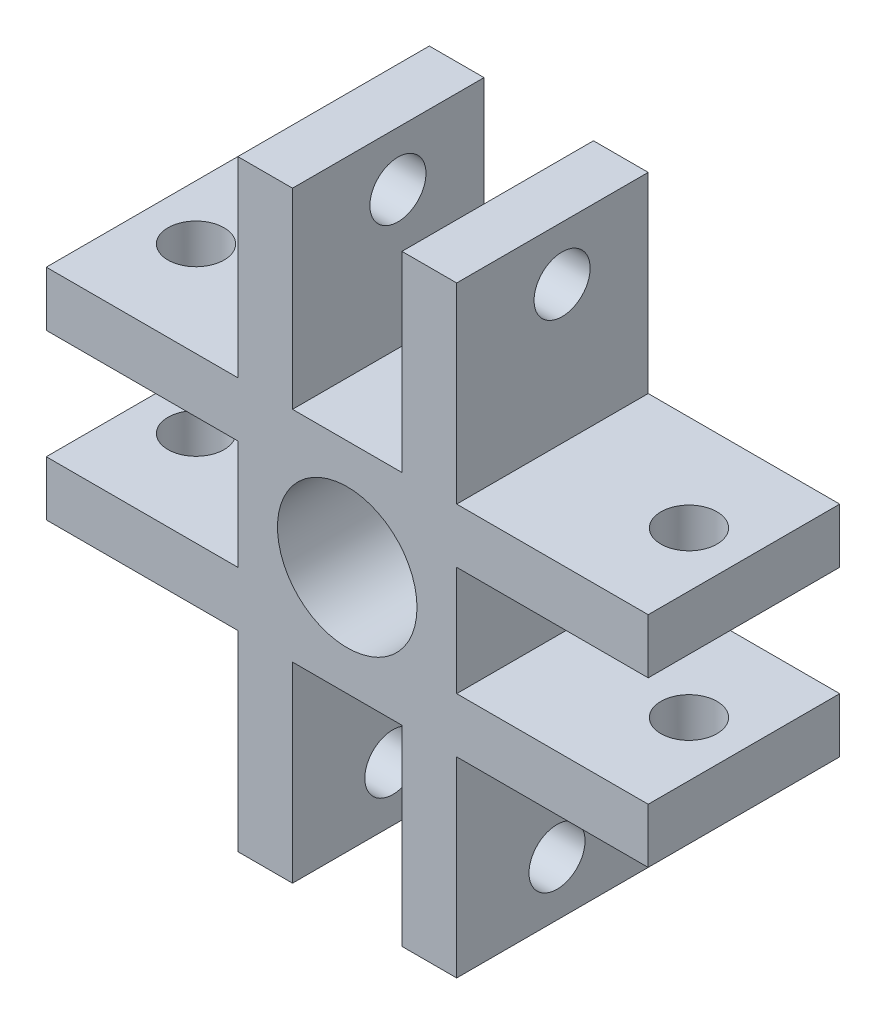
ISO-10303-21;
HEADER;
FILE_DESCRIPTION(('STEP AP214'),'2;1');
FILE_NAME('part.step','',(''),(''),'','','');
FILE_SCHEMA(('AUTOMOTIVE_DESIGN { 1 0 10303 214 1 1 1 1 }'));
ENDSEC;
DATA;
#1=APPLICATION_CONTEXT('core data for automotive mechanical design processes');
#2=APPLICATION_PROTOCOL_DEFINITION('international standard','automotive_design',2000,#1);
#3=PRODUCT_CONTEXT('',#1,'mechanical');
#4=PRODUCT('Part','Part','',(#3));
#5=PRODUCT_RELATED_PRODUCT_CATEGORY('part','',(#4));
#6=PRODUCT_DEFINITION_FORMATION('','',#4);
#7=PRODUCT_DEFINITION_CONTEXT('part definition',#1,'design');
#8=PRODUCT_DEFINITION('design','',#6,#7);
#9=PRODUCT_DEFINITION_SHAPE('','',#8);
#10=(LENGTH_UNIT() NAMED_UNIT(*) SI_UNIT(.MILLI.,.METRE.));
#11=(NAMED_UNIT(*) PLANE_ANGLE_UNIT() SI_UNIT($,.RADIAN.));
#12=(NAMED_UNIT(*) SI_UNIT($,.STERADIAN.) SOLID_ANGLE_UNIT());
#13=UNCERTAINTY_MEASURE_WITH_UNIT(LENGTH_MEASURE(1.E-05),#10,'distance_accuracy_value','');
#14=(GEOMETRIC_REPRESENTATION_CONTEXT(3) GLOBAL_UNCERTAINTY_ASSIGNED_CONTEXT((#13)) GLOBAL_UNIT_ASSIGNED_CONTEXT((#10,
#11,#12)) REPRESENTATION_CONTEXT('',''));
#15=CARTESIAN_POINT('',(0.,0.,0.));
#16=DIRECTION('',(0.,0.,1.));
#17=DIRECTION('',(1.,0.,0.));
#18=AXIS2_PLACEMENT_3D('',#15,#16,#17);
#19=CARTESIAN_POINT('',(11.,-11.,7.));
#20=DIRECTION('',(0.,0.,1.));
#21=DIRECTION('',(1.,0.,0.));
#22=AXIS2_PLACEMENT_3D('',#19,#20,#21);
#23=PLANE('',#22);
#24=CARTESIAN_POINT('',(0.,0.,7.));
#25=DIRECTION('',(0.,0.,1.));
#26=DIRECTION('',(1.,0.,0.));
#27=AXIS2_PLACEMENT_3D('',#24,#25,#26);
#28=CIRCLE('',#27,2.55);
#29=CARTESIAN_POINT('',(2.55,0.,7.));
#30=VERTEX_POINT('',#29);
#31=EDGE_CURVE('E259',#30,#30,#28,.T.);
#32=ORIENTED_EDGE('',*,*,#31,.F.);
#33=EDGE_LOOP('',(#32));
#34=FACE_BOUND('',#33,.T.);
#35=DIRECTION('',(-1.,0.,0.));
#36=VECTOR('',#35,1.);
#37=CARTESIAN_POINT('',(-0.933783745639004,-3.99999999999999,7.));
#38=LINE('',#37,#36);
#39=CARTESIAN_POINT('',(1.99999999999999,-4.00000000000001,7.));
#40=VERTEX_POINT('',#39);
#41=CARTESIAN_POINT('',(-2.00000000000001,-3.99999999999999,7.));
#42=VERTEX_POINT('',#41);
#43=EDGE_CURVE('E256',#40,#42,#38,.T.);
#44=ORIENTED_EDGE('',*,*,#43,.F.);
#45=DIRECTION('',(0.,-1.,0.));
#46=VECTOR('',#45,1.);
#47=CARTESIAN_POINT('',(1.99999999999991,-24.6504822813114,7.));
#48=LINE('',#47,#46);
#49=CARTESIAN_POINT('',(1.99999999999997,-11.,7.));
#50=VERTEX_POINT('',#49);
#51=EDGE_CURVE('E237',#40,#50,#48,.T.);
#52=ORIENTED_EDGE('',*,*,#51,.T.);
#53=DIRECTION('',(1.,0.,0.));
#54=VECTOR('',#53,1.);
#55=CARTESIAN_POINT('',(-11.,-11.,7.));
#56=LINE('',#55,#54);
#57=CARTESIAN_POINT('',(4.00000000000016,-11.,7.));
#58=VERTEX_POINT('',#57);
#59=EDGE_CURVE('E53',#50,#58,#56,.T.);
#60=ORIENTED_EDGE('',*,*,#59,.T.);
#61=DIRECTION('',(0.,-1.,0.));
#62=VECTOR('',#61,1.);
#63=CARTESIAN_POINT('',(4.00000000000016,-4.,7.));
#64=LINE('',#63,#62);
#65=CARTESIAN_POINT('',(4.00000000000016,-4.,7.));
#66=VERTEX_POINT('',#65);
#67=EDGE_CURVE('E349',#66,#58,#64,.T.);
#68=ORIENTED_EDGE('',*,*,#67,.F.);
#69=DIRECTION('',(-1.,0.,0.));
#70=VECTOR('',#69,1.);
#71=CARTESIAN_POINT('',(4.00000000000016,-4.,7.));
#72=LINE('',#71,#70);
#73=CARTESIAN_POINT('',(11.0000000000002,-4.,7.));
#74=VERTEX_POINT('',#73);
#75=EDGE_CURVE('E338',#74,#66,#72,.T.);
#76=ORIENTED_EDGE('',*,*,#75,.F.);
#77=DIRECTION('',(0.,1.,0.));
#78=VECTOR('',#77,1.);
#79=CARTESIAN_POINT('',(11.,11.,7.));
#80=LINE('',#79,#78);
#81=CARTESIAN_POINT('',(11.,-2.,7.));
#82=VERTEX_POINT('',#81);
#83=EDGE_CURVE('E420',#74,#82,#80,.T.);
#84=ORIENTED_EDGE('',*,*,#83,.T.);
#85=DIRECTION('',(1.,0.,0.));
#86=VECTOR('',#85,1.);
#87=CARTESIAN_POINT('',(-0.933783745639071,-2.,7.));
#88=LINE('',#87,#86);
#89=CARTESIAN_POINT('',(4.,-2.,7.));
#90=VERTEX_POINT('',#89);
#91=EDGE_CURVE('E69',#90,#82,#88,.T.);
#92=ORIENTED_EDGE('',*,*,#91,.F.);
#93=DIRECTION('',(0.,-1.,0.));
#94=VECTOR('',#93,1.);
#95=CARTESIAN_POINT('',(4.,-24.6504822813114,7.));
#96=LINE('',#95,#94);
#97=CARTESIAN_POINT('',(4.,2.,7.));
#98=VERTEX_POINT('',#97);
#99=EDGE_CURVE('E283',#98,#90,#96,.T.);
#100=ORIENTED_EDGE('',*,*,#99,.F.);
#101=DIRECTION('',(1.,0.,0.));
#102=VECTOR('',#101,1.);
#103=CARTESIAN_POINT('',(-0.933783745639071,2.,7.));
#104=LINE('',#103,#102);
#105=CARTESIAN_POINT('',(11.,2.,7.));
#106=VERTEX_POINT('',#105);
#107=EDGE_CURVE('E268',#98,#106,#104,.T.);
#108=ORIENTED_EDGE('',*,*,#107,.T.);
#109=CARTESIAN_POINT('',(11.,4.,7.));
#110=VERTEX_POINT('',#109);
#111=EDGE_CURVE('E424',#106,#110,#80,.T.);
#112=ORIENTED_EDGE('',*,*,#111,.T.);
#113=DIRECTION('',(1.,0.,0.));
#114=VECTOR('',#113,1.);
#115=CARTESIAN_POINT('',(4.,4.,7.));
#116=LINE('',#115,#114);
#117=CARTESIAN_POINT('',(4.,4.,7.));
#118=VERTEX_POINT('',#117);
#119=EDGE_CURVE('E386',#118,#110,#116,.T.);
#120=ORIENTED_EDGE('',*,*,#119,.F.);
#121=DIRECTION('',(0.,-1.,0.));
#122=VECTOR('',#121,1.);
#123=CARTESIAN_POINT('',(4.,11.,7.));
#124=LINE('',#123,#122);
#125=CARTESIAN_POINT('',(4.,11.,7.));
#126=VERTEX_POINT('',#125);
#127=EDGE_CURVE('E377',#126,#118,#124,.T.);
#128=ORIENTED_EDGE('',*,*,#127,.F.);
#129=DIRECTION('',(-1.,0.,0.));
#130=VECTOR('',#129,1.);
#131=CARTESIAN_POINT('',(-11.,11.,7.));
#132=LINE('',#131,#130);
#133=CARTESIAN_POINT('',(2.00000000000008,11.,7.));
#134=VERTEX_POINT('',#133);
#135=EDGE_CURVE('E425',#126,#134,#132,.T.);
#136=ORIENTED_EDGE('',*,*,#135,.T.);
#137=DIRECTION('',(0.,1.,0.));
#138=VECTOR('',#137,1.);
#139=CARTESIAN_POINT('',(1.99999999999974,-24.6504822813114,7.));
#140=LINE('',#139,#138);
#141=CARTESIAN_POINT('',(2.00000000000004,3.99999999999998,7.));
#142=VERTEX_POINT('',#141);
#143=EDGE_CURVE('E298',#142,#134,#140,.T.);
#144=ORIENTED_EDGE('',*,*,#143,.F.);
#145=DIRECTION('',(1.,0.,0.));
#146=VECTOR('',#145,1.);
#147=CARTESIAN_POINT('',(-0.933783745638779,4.00000000000001,7.));
#148=LINE('',#147,#146);
#149=CARTESIAN_POINT('',(-1.99999999999996,4.00000000000002,7.));
#150=VERTEX_POINT('',#149);
#151=EDGE_CURVE('E307',#150,#142,#148,.T.);
#152=ORIENTED_EDGE('',*,*,#151,.F.);
#153=DIRECTION('',(0.,1.,0.));
#154=VECTOR('',#153,1.);
#155=CARTESIAN_POINT('',(-2.00000000000026,-24.6504822813114,7.));
#156=LINE('',#155,#154);
#157=CARTESIAN_POINT('',(-1.99999999999992,11.,7.));
#158=VERTEX_POINT('',#157);
#159=EDGE_CURVE('E289',#150,#158,#156,.T.);
#160=ORIENTED_EDGE('',*,*,#159,.T.);
#161=CARTESIAN_POINT('',(-4.,11.,7.));
#162=VERTEX_POINT('',#161);
#163=EDGE_CURVE('E423',#158,#162,#132,.T.);
#164=ORIENTED_EDGE('',*,*,#163,.T.);
#165=DIRECTION('',(0.,1.,0.));
#166=VECTOR('',#165,1.);
#167=CARTESIAN_POINT('',(-4.,11.,7.));
#168=LINE('',#167,#166);
#169=CARTESIAN_POINT('',(-4.,4.,7.));
#170=VERTEX_POINT('',#169);
#171=EDGE_CURVE('E405',#170,#162,#168,.T.);
#172=ORIENTED_EDGE('',*,*,#171,.F.);
#173=DIRECTION('',(1.,0.,0.));
#174=VECTOR('',#173,1.);
#175=CARTESIAN_POINT('',(-11.,4.,7.));
#176=LINE('',#175,#174);
#177=CARTESIAN_POINT('',(-11.,4.,7.));
#178=VERTEX_POINT('',#177);
#179=EDGE_CURVE('E397',#178,#170,#176,.T.);
#180=ORIENTED_EDGE('',*,*,#179,.F.);
#181=DIRECTION('',(0.,-1.,0.));
#182=VECTOR('',#181,1.);
#183=CARTESIAN_POINT('',(-11.,11.,7.));
#184=LINE('',#183,#182);
#185=CARTESIAN_POINT('',(-11.,2.00000000000005,7.));
#186=VERTEX_POINT('',#185);
#187=EDGE_CURVE('E429',#178,#186,#184,.T.);
#188=ORIENTED_EDGE('',*,*,#187,.T.);
#189=DIRECTION('',(-1.,0.,0.));
#190=VECTOR('',#189,1.);
#191=CARTESIAN_POINT('',(-0.933783745638885,2.00000000000001,7.));
#192=LINE('',#191,#190);
#193=CARTESIAN_POINT('',(-3.99999999999999,2.00000000000003,7.));
#194=VERTEX_POINT('',#193);
#195=EDGE_CURVE('E323',#194,#186,#192,.T.);
#196=ORIENTED_EDGE('',*,*,#195,.F.);
#197=DIRECTION('',(0.,1.,0.));
#198=VECTOR('',#197,1.);
#199=CARTESIAN_POINT('',(-4.00000000000017,-24.6504822813114,7.));
#200=LINE('',#199,#198);
#201=CARTESIAN_POINT('',(-4.00000000000001,-1.99999999999997,7.));
#202=VERTEX_POINT('',#201);
#203=EDGE_CURVE('E332',#202,#194,#200,.T.);
#204=ORIENTED_EDGE('',*,*,#203,.F.);
#205=DIRECTION('',(-1.,0.,0.));
#206=VECTOR('',#205,1.);
#207=CARTESIAN_POINT('',(-0.933783745638913,-1.99999999999999,7.));
#208=LINE('',#207,#206);
#209=CARTESIAN_POINT('',(-11.,-1.99999999999995,7.));
#210=VERTEX_POINT('',#209);
#211=EDGE_CURVE('E313',#202,#210,#208,.T.);
#212=ORIENTED_EDGE('',*,*,#211,.T.);
#213=CARTESIAN_POINT('',(-10.9999999999998,-4.,7.));
#214=VERTEX_POINT('',#213);
#215=EDGE_CURVE('E428',#210,#214,#184,.T.);
#216=ORIENTED_EDGE('',*,*,#215,.T.);
#217=DIRECTION('',(-1.,0.,0.));
#218=VECTOR('',#217,1.);
#219=CARTESIAN_POINT('',(-10.9999999999998,-4.,7.));
#220=LINE('',#219,#218);
#221=CARTESIAN_POINT('',(-3.99999999999984,-4.,7.));
#222=VERTEX_POINT('',#221);
#223=EDGE_CURVE('E358',#222,#214,#220,.T.);
#224=ORIENTED_EDGE('',*,*,#223,.F.);
#225=DIRECTION('',(0.,1.,0.));
#226=VECTOR('',#225,1.);
#227=CARTESIAN_POINT('',(-3.99999999999984,-4.,7.));
#228=LINE('',#227,#226);
#229=CARTESIAN_POINT('',(-3.99999999999984,-11.,7.));
#230=VERTEX_POINT('',#229);
#231=EDGE_CURVE('E367',#230,#222,#228,.T.);
#232=ORIENTED_EDGE('',*,*,#231,.F.);
#233=CARTESIAN_POINT('',(-2.00000000000003,-11.,7.));
#234=VERTEX_POINT('',#233);
#235=EDGE_CURVE('E13',#230,#234,#56,.T.);
#236=ORIENTED_EDGE('',*,*,#235,.T.);
#237=DIRECTION('',(0.,-1.,0.));
#238=VECTOR('',#237,1.);
#239=CARTESIAN_POINT('',(-2.00000000000009,-24.6504822813114,7.));
#240=LINE('',#239,#238);
#241=EDGE_CURVE('E61',#42,#234,#240,.T.);
#242=ORIENTED_EDGE('',*,*,#241,.F.);
#243=EDGE_LOOP('',(#44,#52,#60,#68,#76,#84,#92,#100,#108,#112,#120,#128,#136,#144,#152,#160,
#164,#172,#180,#188,#196,#204,#212,#216,#224,#232,#236,#242));
#244=FACE_BOUND('',#243,.T.);
#245=ADVANCED_FACE('F44',(#34,#244),#23,.T.);
#246=CARTESIAN_POINT('',(11.,-11.,0.));
#247=DIRECTION('',(0.,0.,1.));
#248=DIRECTION('',(1.,0.,0.));
#249=AXIS2_PLACEMENT_3D('',#246,#247,#248);
#250=PLANE('',#249);
#251=CARTESIAN_POINT('',(0.,0.,0.));
#252=DIRECTION('',(0.,0.,1.));
#253=DIRECTION('',(1.,0.,0.));
#254=AXIS2_PLACEMENT_3D('',#251,#252,#253);
#255=CIRCLE('',#254,2.55);
#256=CARTESIAN_POINT('',(2.55,0.,0.));
#257=VERTEX_POINT('',#256);
#258=EDGE_CURVE('E264',#257,#257,#255,.T.);
#259=ORIENTED_EDGE('',*,*,#258,.T.);
#260=EDGE_LOOP('',(#259));
#261=FACE_BOUND('',#260,.T.);
#262=DIRECTION('',(0.,-1.,0.));
#263=VECTOR('',#262,1.);
#264=CARTESIAN_POINT('',(1.99999999999991,-24.6504822813114,0.));
#265=LINE('',#264,#263);
#266=CARTESIAN_POINT('',(1.99999999999999,-4.00000000000001,0.));
#267=VERTEX_POINT('',#266);
#268=CARTESIAN_POINT('',(1.99999999999997,-11.,0.));
#269=VERTEX_POINT('',#268);
#270=EDGE_CURVE('E234',#267,#269,#265,.T.);
#271=ORIENTED_EDGE('',*,*,#270,.F.);
#272=DIRECTION('',(-1.,0.,0.));
#273=VECTOR('',#272,1.);
#274=CARTESIAN_POINT('',(-0.933783745639004,-3.99999999999999,0.));
#275=LINE('',#274,#273);
#276=CARTESIAN_POINT('',(-2.00000000000001,-3.99999999999999,0.));
#277=VERTEX_POINT('',#276);
#278=EDGE_CURVE('E245',#267,#277,#275,.T.);
#279=ORIENTED_EDGE('',*,*,#278,.T.);
#280=DIRECTION('',(0.,-1.,0.));
#281=VECTOR('',#280,1.);
#282=CARTESIAN_POINT('',(-2.00000000000009,-24.6504822813114,0.));
#283=LINE('',#282,#281);
#284=CARTESIAN_POINT('',(-2.00000000000003,-11.,0.));
#285=VERTEX_POINT('',#284);
#286=EDGE_CURVE('E242',#277,#285,#283,.T.);
#287=ORIENTED_EDGE('',*,*,#286,.T.);
#288=DIRECTION('',(1.,0.,0.));
#289=VECTOR('',#288,1.);
#290=CARTESIAN_POINT('',(-11.,-11.,0.));
#291=LINE('',#290,#289);
#292=CARTESIAN_POINT('',(-3.99999999999984,-11.,0.));
#293=VERTEX_POINT('',#292);
#294=EDGE_CURVE('E443',#293,#285,#291,.T.);
#295=ORIENTED_EDGE('',*,*,#294,.F.);
#296=DIRECTION('',(0.,1.,0.));
#297=VECTOR('',#296,1.);
#298=CARTESIAN_POINT('',(-3.99999999999984,-4.,0.));
#299=LINE('',#298,#297);
#300=CARTESIAN_POINT('',(-3.99999999999984,-4.,0.));
#301=VERTEX_POINT('',#300);
#302=EDGE_CURVE('E366',#293,#301,#299,.T.);
#303=ORIENTED_EDGE('',*,*,#302,.T.);
#304=DIRECTION('',(-1.,0.,0.));
#305=VECTOR('',#304,1.);
#306=CARTESIAN_POINT('',(-10.9999999999998,-4.,0.));
#307=LINE('',#306,#305);
#308=CARTESIAN_POINT('',(-10.9999999999998,-4.,0.));
#309=VERTEX_POINT('',#308);
#310=EDGE_CURVE('E363',#301,#309,#307,.T.);
#311=ORIENTED_EDGE('',*,*,#310,.T.);
#312=DIRECTION('',(0.,-1.,0.));
#313=VECTOR('',#312,1.);
#314=CARTESIAN_POINT('',(-11.,11.,0.));
#315=LINE('',#314,#313);
#316=CARTESIAN_POINT('',(-11.,-1.99999999999995,0.));
#317=VERTEX_POINT('',#316);
#318=EDGE_CURVE('E439',#317,#309,#315,.T.);
#319=ORIENTED_EDGE('',*,*,#318,.F.);
#320=DIRECTION('',(-1.,0.,0.));
#321=VECTOR('',#320,1.);
#322=CARTESIAN_POINT('',(-0.933783745638913,-1.99999999999999,0.));
#323=LINE('',#322,#321);
#324=CARTESIAN_POINT('',(-4.00000000000001,-1.99999999999997,0.));
#325=VERTEX_POINT('',#324);
#326=EDGE_CURVE('E320',#325,#317,#323,.T.);
#327=ORIENTED_EDGE('',*,*,#326,.F.);
#328=DIRECTION('',(0.,1.,0.));
#329=VECTOR('',#328,1.);
#330=CARTESIAN_POINT('',(-4.00000000000017,-24.6504822813114,0.));
#331=LINE('',#330,#329);
#332=CARTESIAN_POINT('',(-3.99999999999999,2.00000000000003,0.));
#333=VERTEX_POINT('',#332);
#334=EDGE_CURVE('E322',#325,#333,#331,.T.);
#335=ORIENTED_EDGE('',*,*,#334,.T.);
#336=DIRECTION('',(-1.,0.,0.));
#337=VECTOR('',#336,1.);
#338=CARTESIAN_POINT('',(-0.933783745638885,2.00000000000001,0.));
#339=LINE('',#338,#337);
#340=CARTESIAN_POINT('',(-11.,2.00000000000005,0.));
#341=VERTEX_POINT('',#340);
#342=EDGE_CURVE('E326',#333,#341,#339,.T.);
#343=ORIENTED_EDGE('',*,*,#342,.T.);
#344=CARTESIAN_POINT('',(-11.,4.,0.));
#345=VERTEX_POINT('',#344);
#346=EDGE_CURVE('E440',#345,#341,#315,.T.);
#347=ORIENTED_EDGE('',*,*,#346,.F.);
#348=DIRECTION('',(1.,0.,0.));
#349=VECTOR('',#348,1.);
#350=CARTESIAN_POINT('',(-11.,4.,0.));
#351=LINE('',#350,#349);
#352=CARTESIAN_POINT('',(-4.,4.,0.));
#353=VERTEX_POINT('',#352);
#354=EDGE_CURVE('E401',#345,#353,#351,.T.);
#355=ORIENTED_EDGE('',*,*,#354,.T.);
#356=DIRECTION('',(0.,1.,0.));
#357=VECTOR('',#356,1.);
#358=CARTESIAN_POINT('',(-4.,11.,0.));
#359=LINE('',#358,#357);
#360=CARTESIAN_POINT('',(-4.,11.,0.));
#361=VERTEX_POINT('',#360);
#362=EDGE_CURVE('E404',#353,#361,#359,.T.);
#363=ORIENTED_EDGE('',*,*,#362,.T.);
#364=DIRECTION('',(-1.,0.,0.));
#365=VECTOR('',#364,1.);
#366=CARTESIAN_POINT('',(-11.,11.,0.));
#367=LINE('',#366,#365);
#368=CARTESIAN_POINT('',(-1.99999999999992,11.,0.));
#369=VERTEX_POINT('',#368);
#370=EDGE_CURVE('E435',#369,#361,#367,.T.);
#371=ORIENTED_EDGE('',*,*,#370,.F.);
#372=DIRECTION('',(0.,1.,0.));
#373=VECTOR('',#372,1.);
#374=CARTESIAN_POINT('',(-2.00000000000026,-24.6504822813114,0.));
#375=LINE('',#374,#373);
#376=CARTESIAN_POINT('',(-1.99999999999996,4.00000000000002,0.));
#377=VERTEX_POINT('',#376);
#378=EDGE_CURVE('E295',#377,#369,#375,.T.);
#379=ORIENTED_EDGE('',*,*,#378,.F.);
#380=DIRECTION('',(1.,0.,0.));
#381=VECTOR('',#380,1.);
#382=CARTESIAN_POINT('',(-0.933783745638779,4.00000000000001,0.));
#383=LINE('',#382,#381);
#384=CARTESIAN_POINT('',(2.00000000000004,3.99999999999998,0.));
#385=VERTEX_POINT('',#384);
#386=EDGE_CURVE('E297',#377,#385,#383,.T.);
#387=ORIENTED_EDGE('',*,*,#386,.T.);
#388=DIRECTION('',(0.,1.,0.));
#389=VECTOR('',#388,1.);
#390=CARTESIAN_POINT('',(1.99999999999974,-24.6504822813114,0.));
#391=LINE('',#390,#389);
#392=CARTESIAN_POINT('',(2.00000000000008,11.,0.));
#393=VERTEX_POINT('',#392);
#394=EDGE_CURVE('E301',#385,#393,#391,.T.);
#395=ORIENTED_EDGE('',*,*,#394,.T.);
#396=CARTESIAN_POINT('',(4.,11.,0.));
#397=VERTEX_POINT('',#396);
#398=EDGE_CURVE('E436',#397,#393,#367,.T.);
#399=ORIENTED_EDGE('',*,*,#398,.F.);
#400=DIRECTION('',(0.,-1.,0.));
#401=VECTOR('',#400,1.);
#402=CARTESIAN_POINT('',(4.,11.,0.));
#403=LINE('',#402,#401);
#404=CARTESIAN_POINT('',(4.,4.,0.));
#405=VERTEX_POINT('',#404);
#406=EDGE_CURVE('E382',#397,#405,#403,.T.);
#407=ORIENTED_EDGE('',*,*,#406,.T.);
#408=DIRECTION('',(1.,0.,0.));
#409=VECTOR('',#408,1.);
#410=CARTESIAN_POINT('',(4.,4.,0.));
#411=LINE('',#410,#409);
#412=CARTESIAN_POINT('',(11.,4.,0.));
#413=VERTEX_POINT('',#412);
#414=EDGE_CURVE('E385',#405,#413,#411,.T.);
#415=ORIENTED_EDGE('',*,*,#414,.T.);
#416=DIRECTION('',(0.,1.,0.));
#417=VECTOR('',#416,1.);
#418=CARTESIAN_POINT('',(11.,11.,0.));
#419=LINE('',#418,#417);
#420=CARTESIAN_POINT('',(11.,2.,0.));
#421=VERTEX_POINT('',#420);
#422=EDGE_CURVE('E416',#421,#413,#419,.T.);
#423=ORIENTED_EDGE('',*,*,#422,.F.);
#424=DIRECTION('',(1.,0.,0.));
#425=VECTOR('',#424,1.);
#426=CARTESIAN_POINT('',(-0.933783745639071,2.,0.));
#427=LINE('',#426,#425);
#428=CARTESIAN_POINT('',(4.,2.,0.));
#429=VERTEX_POINT('',#428);
#430=EDGE_CURVE('E272',#429,#421,#427,.T.);
#431=ORIENTED_EDGE('',*,*,#430,.F.);
#432=DIRECTION('',(0.,-1.,0.));
#433=VECTOR('',#432,1.);
#434=CARTESIAN_POINT('',(4.,-24.6504822813114,0.));
#435=LINE('',#434,#433);
#436=CARTESIAN_POINT('',(4.,-2.,0.));
#437=VERTEX_POINT('',#436);
#438=EDGE_CURVE('E274',#429,#437,#435,.T.);
#439=ORIENTED_EDGE('',*,*,#438,.T.);
#440=DIRECTION('',(1.,0.,0.));
#441=VECTOR('',#440,1.);
#442=CARTESIAN_POINT('',(-0.933783745639071,-2.,0.));
#443=LINE('',#442,#441);
#444=CARTESIAN_POINT('',(11.,-2.,0.));
#445=VERTEX_POINT('',#444);
#446=EDGE_CURVE('E277',#437,#445,#443,.T.);
#447=ORIENTED_EDGE('',*,*,#446,.T.);
#448=CARTESIAN_POINT('',(11.0000000000002,-4.,0.));
#449=VERTEX_POINT('',#448);
#450=EDGE_CURVE('E432',#449,#445,#419,.T.);
#451=ORIENTED_EDGE('',*,*,#450,.F.);
#452=DIRECTION('',(-1.,0.,0.));
#453=VECTOR('',#452,1.);
#454=CARTESIAN_POINT('',(4.00000000000016,-4.,0.));
#455=LINE('',#454,#453);
#456=CARTESIAN_POINT('',(4.00000000000016,-4.,0.));
#457=VERTEX_POINT('',#456);
#458=EDGE_CURVE('E345',#449,#457,#455,.T.);
#459=ORIENTED_EDGE('',*,*,#458,.T.);
#460=DIRECTION('',(0.,-1.,0.));
#461=VECTOR('',#460,1.);
#462=CARTESIAN_POINT('',(4.00000000000016,-4.,0.));
#463=LINE('',#462,#461);
#464=CARTESIAN_POINT('',(4.00000000000016,-11.,0.));
#465=VERTEX_POINT('',#464);
#466=EDGE_CURVE('E348',#457,#465,#463,.T.);
#467=ORIENTED_EDGE('',*,*,#466,.T.);
#468=EDGE_CURVE('E254',#269,#465,#291,.T.);
#469=ORIENTED_EDGE('',*,*,#468,.F.);
#470=EDGE_LOOP('',(#271,#279,#287,#295,#303,#311,#319,#327,#335,#343,#347,#355,#363,#371,#379,
#387,#395,#399,#407,#415,#423,#431,#439,#447,#451,#459,#467,#469));
#471=FACE_BOUND('',#470,.T.);
#472=ADVANCED_FACE('F252',(#261,#471),#250,.F.);
#473=CARTESIAN_POINT('',(-11.,-11.,7.));
#474=DIRECTION('',(0.,1.,0.));
#475=DIRECTION('',(0.,0.,1.));
#476=AXIS2_PLACEMENT_3D('',#473,#474,#475);
#477=PLANE('',#476);
#478=DIRECTION('',(0.,0.,1.));
#479=VECTOR('',#478,1.);
#480=CARTESIAN_POINT('',(1.99999999999997,-11.,0.));
#481=LINE('',#480,#479);
#482=EDGE_CURVE('E266',#269,#50,#481,.T.);
#483=ORIENTED_EDGE('',*,*,#482,.F.);
#484=ORIENTED_EDGE('',*,*,#468,.T.);
#485=DIRECTION('',(0.,0.,1.));
#486=VECTOR('',#485,1.);
#487=CARTESIAN_POINT('',(4.00000000000016,-11.,0.));
#488=LINE('',#487,#486);
#489=EDGE_CURVE('E359',#465,#58,#488,.T.);
#490=ORIENTED_EDGE('',*,*,#489,.T.);
#491=ORIENTED_EDGE('',*,*,#59,.F.);
#492=EDGE_LOOP('',(#483,#484,#490,#491));
#493=FACE_BOUND('',#492,.T.);
#494=ADVANCED_FACE('F604',(#493),#477,.F.);
#495=CARTESIAN_POINT('',(11.,11.,7.));
#496=DIRECTION('',(-1.,0.,0.));
#497=DIRECTION('',(0.,-1.,0.));
#498=AXIS2_PLACEMENT_3D('',#495,#496,#497);
#499=PLANE('',#498);
#500=DIRECTION('',(0.,0.,1.));
#501=VECTOR('',#500,1.);
#502=CARTESIAN_POINT('',(11.,2.,0.));
#503=LINE('',#502,#501);
#504=EDGE_CURVE('E287',#421,#106,#503,.T.);
#505=ORIENTED_EDGE('',*,*,#504,.F.);
#506=ORIENTED_EDGE('',*,*,#422,.T.);
#507=DIRECTION('',(0.,0.,1.));
#508=VECTOR('',#507,1.);
#509=CARTESIAN_POINT('',(11.,4.,0.));
#510=LINE('',#509,#508);
#511=EDGE_CURVE('E394',#413,#110,#510,.T.);
#512=ORIENTED_EDGE('',*,*,#511,.T.);
#513=ORIENTED_EDGE('',*,*,#111,.F.);
#514=EDGE_LOOP('',(#505,#506,#512,#513));
#515=FACE_BOUND('',#514,.T.);
#516=ADVANCED_FACE('F579',(#515),#499,.F.);
#517=CARTESIAN_POINT('',(-11.,11.,7.));
#518=DIRECTION('',(0.,-1.,0.));
#519=DIRECTION('',(0.,0.,-1.));
#520=AXIS2_PLACEMENT_3D('',#517,#518,#519);
#521=PLANE('',#520);
#522=DIRECTION('',(0.,0.,1.));
#523=VECTOR('',#522,1.);
#524=CARTESIAN_POINT('',(-1.99999999999992,11.,0.));
#525=LINE('',#524,#523);
#526=EDGE_CURVE('E311',#369,#158,#525,.T.);
#527=ORIENTED_EDGE('',*,*,#526,.F.);
#528=ORIENTED_EDGE('',*,*,#370,.T.);
#529=DIRECTION('',(0.,0.,1.));
#530=VECTOR('',#529,1.);
#531=CARTESIAN_POINT('',(-4.,11.,0.));
#532=LINE('',#531,#530);
#533=EDGE_CURVE('E413',#361,#162,#532,.T.);
#534=ORIENTED_EDGE('',*,*,#533,.T.);
#535=ORIENTED_EDGE('',*,*,#163,.F.);
#536=EDGE_LOOP('',(#527,#528,#534,#535));
#537=FACE_BOUND('',#536,.T.);
#538=ADVANCED_FACE('F549',(#537),#521,.F.);
#539=CARTESIAN_POINT('',(-11.,11.,7.));
#540=DIRECTION('',(1.,0.,0.));
#541=DIRECTION('',(0.,1.,0.));
#542=AXIS2_PLACEMENT_3D('',#539,#540,#541);
#543=PLANE('',#542);
#544=DIRECTION('',(0.,0.,1.));
#545=VECTOR('',#544,1.);
#546=CARTESIAN_POINT('',(-11.,-1.99999999999995,0.));
#547=LINE('',#546,#545);
#548=EDGE_CURVE('E336',#317,#210,#547,.T.);
#549=ORIENTED_EDGE('',*,*,#548,.F.);
#550=ORIENTED_EDGE('',*,*,#318,.T.);
#551=DIRECTION('',(0.,0.,1.));
#552=VECTOR('',#551,1.);
#553=CARTESIAN_POINT('',(-10.9999999999998,-4.,0.));
#554=LINE('',#553,#552);
#555=EDGE_CURVE('E370',#309,#214,#554,.T.);
#556=ORIENTED_EDGE('',*,*,#555,.T.);
#557=ORIENTED_EDGE('',*,*,#215,.F.);
#558=EDGE_LOOP('',(#549,#550,#556,#557));
#559=FACE_BOUND('',#558,.T.);
#560=ADVANCED_FACE('F520',(#559),#543,.F.);
#561=ORIENTED_EDGE('',*,*,#450,.T.);
#562=DIRECTION('',(0.,0.,1.));
#563=VECTOR('',#562,1.);
#564=CARTESIAN_POINT('',(11.,-2.,0.));
#565=LINE('',#564,#563);
#566=EDGE_CURVE('E290',#445,#82,#565,.T.);
#567=ORIENTED_EDGE('',*,*,#566,.T.);
#568=ORIENTED_EDGE('',*,*,#83,.F.);
#569=DIRECTION('',(0.,0.,1.));
#570=VECTOR('',#569,1.);
#571=CARTESIAN_POINT('',(11.0000000000002,-4.,0.));
#572=LINE('',#571,#570);
#573=EDGE_CURVE('E356',#449,#74,#572,.T.);
#574=ORIENTED_EDGE('',*,*,#573,.F.);
#575=EDGE_LOOP('',(#561,#567,#568,#574));
#576=FACE_BOUND('',#575,.T.);
#577=ADVANCED_FACE('F46',(#576),#499,.F.);
#578=ORIENTED_EDGE('',*,*,#398,.T.);
#579=DIRECTION('',(0.,0.,1.));
#580=VECTOR('',#579,1.);
#581=CARTESIAN_POINT('',(2.00000000000008,11.,0.));
#582=LINE('',#581,#580);
#583=EDGE_CURVE('E314',#393,#134,#582,.T.);
#584=ORIENTED_EDGE('',*,*,#583,.T.);
#585=ORIENTED_EDGE('',*,*,#135,.F.);
#586=DIRECTION('',(0.,0.,1.));
#587=VECTOR('',#586,1.);
#588=CARTESIAN_POINT('',(4.,11.,0.));
#589=LINE('',#588,#587);
#590=EDGE_CURVE('E389',#397,#126,#589,.T.);
#591=ORIENTED_EDGE('',*,*,#590,.F.);
#592=EDGE_LOOP('',(#578,#584,#585,#591));
#593=FACE_BOUND('',#592,.T.);
#594=ADVANCED_FACE('F566',(#593),#521,.F.);
#595=ORIENTED_EDGE('',*,*,#346,.T.);
#596=DIRECTION('',(0.,0.,1.));
#597=VECTOR('',#596,1.);
#598=CARTESIAN_POINT('',(-11.,2.00000000000005,0.));
#599=LINE('',#598,#597);
#600=EDGE_CURVE('E339',#341,#186,#599,.T.);
#601=ORIENTED_EDGE('',*,*,#600,.T.);
#602=ORIENTED_EDGE('',*,*,#187,.F.);
#603=DIRECTION('',(0.,0.,1.));
#604=VECTOR('',#603,1.);
#605=CARTESIAN_POINT('',(-11.,4.,0.));
#606=LINE('',#605,#604);
#607=EDGE_CURVE('E408',#345,#178,#606,.T.);
#608=ORIENTED_EDGE('',*,*,#607,.F.);
#609=EDGE_LOOP('',(#595,#601,#602,#608));
#610=FACE_BOUND('',#609,.T.);
#611=ADVANCED_FACE('F536',(#610),#543,.F.);
#612=ORIENTED_EDGE('',*,*,#294,.T.);
#613=DIRECTION('',(0.,0.,1.));
#614=VECTOR('',#613,1.);
#615=CARTESIAN_POINT('',(-2.00000000000003,-11.,0.));
#616=LINE('',#615,#614);
#617=EDGE_CURVE('E269',#285,#234,#616,.T.);
#618=ORIENTED_EDGE('',*,*,#617,.T.);
#619=ORIENTED_EDGE('',*,*,#235,.F.);
#620=DIRECTION('',(0.,0.,1.));
#621=VECTOR('',#620,1.);
#622=CARTESIAN_POINT('',(-3.99999999999984,-11.,0.));
#623=LINE('',#622,#621);
#624=EDGE_CURVE('E378',#293,#230,#623,.T.);
#625=ORIENTED_EDGE('',*,*,#624,.F.);
#626=EDGE_LOOP('',(#612,#618,#619,#625));
#627=FACE_BOUND('',#626,.T.);
#628=ADVANCED_FACE('F507',(#627),#477,.F.);
#629=CARTESIAN_POINT('',(-4.,11.,0.));
#630=DIRECTION('',(1.,0.,0.));
#631=DIRECTION('',(0.,0.,-1.));
#632=AXIS2_PLACEMENT_3D('',#629,#630,#631);
#633=PLANE('',#632);
#634=CARTESIAN_POINT('',(-4.,9.0313609981526,3.14721043041883));
#635=DIRECTION('',(1.,0.,0.));
#636=DIRECTION('',(0.,0.,-1.));
#637=AXIS2_PLACEMENT_3D('',#634,#635,#636);
#638=CIRCLE('',#637,1.025);
#639=CARTESIAN_POINT('',(-4.,9.0313609981526,2.12221043041883));
#640=VERTEX_POINT('',#639);
#641=EDGE_CURVE('E488',#640,#640,#638,.T.);
#642=ORIENTED_EDGE('',*,*,#641,.T.);
#643=EDGE_LOOP('',(#642));
#644=FACE_BOUND('',#643,.T.);
#645=ORIENTED_EDGE('',*,*,#171,.T.);
#646=ORIENTED_EDGE('',*,*,#533,.F.);
#647=ORIENTED_EDGE('',*,*,#362,.F.);
#648=DIRECTION('',(0.,0.,1.));
#649=VECTOR('',#648,1.);
#650=CARTESIAN_POINT('',(-4.,4.,0.));
#651=LINE('',#650,#649);
#652=EDGE_CURVE('E417',#353,#170,#651,.T.);
#653=ORIENTED_EDGE('',*,*,#652,.T.);
#654=EDGE_LOOP('',(#645,#646,#647,#653));
#655=FACE_BOUND('',#654,.T.);
#656=ADVANCED_FACE('F546',(#644,#655),#633,.F.);
#657=CARTESIAN_POINT('',(-11.,4.,0.));
#658=DIRECTION('',(0.,-1.,0.));
#659=DIRECTION('',(0.,0.,-1.));
#660=AXIS2_PLACEMENT_3D('',#657,#658,#659);
#661=PLANE('',#660);
#662=CARTESIAN_POINT('',(-8.99999999999984,4.,3.5269766343049));
#663=DIRECTION('',(0.,-1.,0.));
#664=DIRECTION('',(0.,0.,-1.));
#665=AXIS2_PLACEMENT_3D('',#662,#663,#664);
#666=CIRCLE('',#665,1.025);
#667=CARTESIAN_POINT('',(-8.99999999999984,4.,2.5019766343049));
#668=VERTEX_POINT('',#667);
#669=EDGE_CURVE('E482',#668,#668,#666,.T.);
#670=ORIENTED_EDGE('',*,*,#669,.T.);
#671=EDGE_LOOP('',(#670));
#672=FACE_BOUND('',#671,.T.);
#673=ORIENTED_EDGE('',*,*,#179,.T.);
#674=ORIENTED_EDGE('',*,*,#652,.F.);
#675=ORIENTED_EDGE('',*,*,#354,.F.);
#676=ORIENTED_EDGE('',*,*,#607,.T.);
#677=EDGE_LOOP('',(#673,#674,#675,#676));
#678=FACE_BOUND('',#677,.T.);
#679=ADVANCED_FACE('F540',(#672,#678),#661,.F.);
#680=CARTESIAN_POINT('',(4.,4.,0.));
#681=DIRECTION('',(0.,-1.,0.));
#682=DIRECTION('',(0.,0.,-1.));
#683=AXIS2_PLACEMENT_3D('',#680,#681,#682);
#684=PLANE('',#683);
#685=CARTESIAN_POINT('',(9.,4.,3.51045164111952));
#686=DIRECTION('',(0.,1.,0.));
#687=DIRECTION('',(0.,0.,1.));
#688=AXIS2_PLACEMENT_3D('',#685,#686,#687);
#689=CIRCLE('',#688,1.025);
#690=CARTESIAN_POINT('',(9.,4.,4.53545164111952));
#691=VERTEX_POINT('',#690);
#692=EDGE_CURVE('E902',#691,#691,#689,.T.);
#693=ORIENTED_EDGE('',*,*,#692,.F.);
#694=EDGE_LOOP('',(#693));
#695=FACE_BOUND('',#694,.T.);
#696=ORIENTED_EDGE('',*,*,#119,.T.);
#697=ORIENTED_EDGE('',*,*,#511,.F.);
#698=ORIENTED_EDGE('',*,*,#414,.F.);
#699=DIRECTION('',(0.,0.,1.));
#700=VECTOR('',#699,1.);
#701=CARTESIAN_POINT('',(4.,4.,0.));
#702=LINE('',#701,#700);
#703=EDGE_CURVE('E398',#405,#118,#702,.T.);
#704=ORIENTED_EDGE('',*,*,#703,.T.);
#705=EDGE_LOOP('',(#696,#697,#698,#704));
#706=FACE_BOUND('',#705,.T.);
#707=ADVANCED_FACE('F576',(#695,#706),#684,.F.);
#708=CARTESIAN_POINT('',(4.,11.,0.));
#709=DIRECTION('',(-1.,0.,0.));
#710=DIRECTION('',(0.,-1.,0.));
#711=AXIS2_PLACEMENT_3D('',#708,#709,#710);
#712=PLANE('',#711);
#713=CARTESIAN_POINT('',(4.,9.0313609981526,3.14721043041883));
#714=DIRECTION('',(1.,0.,0.));
#715=DIRECTION('',(0.,1.,0.));
#716=AXIS2_PLACEMENT_3D('',#713,#714,#715);
#717=CIRCLE('',#716,1.025);
#718=CARTESIAN_POINT('',(4.,10.0563609981526,3.14721043041883));
#719=VERTEX_POINT('',#718);
#720=EDGE_CURVE('E452',#719,#719,#717,.T.);
#721=ORIENTED_EDGE('',*,*,#720,.F.);
#722=EDGE_LOOP('',(#721));
#723=FACE_BOUND('',#722,.T.);
#724=ORIENTED_EDGE('',*,*,#127,.T.);
#725=ORIENTED_EDGE('',*,*,#703,.F.);
#726=ORIENTED_EDGE('',*,*,#406,.F.);
#727=ORIENTED_EDGE('',*,*,#590,.T.);
#728=EDGE_LOOP('',(#724,#725,#726,#727));
#729=FACE_BOUND('',#728,.T.);
#730=ADVANCED_FACE('F570',(#723,#729),#712,.F.);
#731=CARTESIAN_POINT('',(-10.9999999999998,-4.,0.));
#732=DIRECTION('',(0.,1.,0.));
#733=DIRECTION('',(0.,0.,1.));
#734=AXIS2_PLACEMENT_3D('',#731,#732,#733);
#735=PLANE('',#734);
#736=CARTESIAN_POINT('',(-8.99999999999984,-4.,3.5269766343049));
#737=DIRECTION('',(0.,-1.,0.));
#738=DIRECTION('',(0.,0.,-1.));
#739=AXIS2_PLACEMENT_3D('',#736,#737,#738);
#740=CIRCLE('',#739,1.025);
#741=CARTESIAN_POINT('',(-8.99999999999984,-4.,2.5019766343049));
#742=VERTEX_POINT('',#741);
#743=EDGE_CURVE('E456',#742,#742,#740,.T.);
#744=ORIENTED_EDGE('',*,*,#743,.F.);
#745=EDGE_LOOP('',(#744));
#746=FACE_BOUND('',#745,.T.);
#747=ORIENTED_EDGE('',*,*,#223,.T.);
#748=ORIENTED_EDGE('',*,*,#555,.F.);
#749=ORIENTED_EDGE('',*,*,#310,.F.);
#750=DIRECTION('',(0.,0.,1.));
#751=VECTOR('',#750,1.);
#752=CARTESIAN_POINT('',(-3.99999999999984,-4.,0.));
#753=LINE('',#752,#751);
#754=EDGE_CURVE('E375',#301,#222,#753,.T.);
#755=ORIENTED_EDGE('',*,*,#754,.T.);
#756=EDGE_LOOP('',(#747,#748,#749,#755));
#757=FACE_BOUND('',#756,.T.);
#758=ADVANCED_FACE('F515',(#746,#757),#735,.F.);
#759=CARTESIAN_POINT('',(-3.99999999999984,-4.,0.));
#760=DIRECTION('',(1.,0.,0.));
#761=DIRECTION('',(0.,0.,-1.));
#762=AXIS2_PLACEMENT_3D('',#759,#760,#761);
#763=PLANE('',#762);
#764=CARTESIAN_POINT('',(-3.99999999999984,-9.,3.33253534446243));
#765=DIRECTION('',(1.,0.,0.));
#766=DIRECTION('',(0.,0.,-1.));
#767=AXIS2_PLACEMENT_3D('',#764,#765,#766);
#768=CIRCLE('',#767,1.025);
#769=CARTESIAN_POINT('',(-3.99999999999984,-9.,2.30753534446243));
#770=VERTEX_POINT('',#769);
#771=EDGE_CURVE('E464',#770,#770,#768,.T.);
#772=ORIENTED_EDGE('',*,*,#771,.T.);
#773=EDGE_LOOP('',(#772));
#774=FACE_BOUND('',#773,.T.);
#775=ORIENTED_EDGE('',*,*,#231,.T.);
#776=ORIENTED_EDGE('',*,*,#754,.F.);
#777=ORIENTED_EDGE('',*,*,#302,.F.);
#778=ORIENTED_EDGE('',*,*,#624,.T.);
#779=EDGE_LOOP('',(#775,#776,#777,#778));
#780=FACE_BOUND('',#779,.T.);
#781=ADVANCED_FACE('F513',(#774,#780),#763,.F.);
#782=CARTESIAN_POINT('',(4.00000000000016,-4.,0.));
#783=DIRECTION('',(0.,1.,0.));
#784=DIRECTION('',(0.,0.,1.));
#785=AXIS2_PLACEMENT_3D('',#782,#783,#784);
#786=PLANE('',#785);
#787=CARTESIAN_POINT('',(9.,-4.,3.51045164111952));
#788=DIRECTION('',(0.,1.,0.));
#789=DIRECTION('',(0.,0.,1.));
#790=AXIS2_PLACEMENT_3D('',#787,#788,#789);
#791=CIRCLE('',#790,1.025);
#792=CARTESIAN_POINT('',(9.,-4.,4.53545164111952));
#793=VERTEX_POINT('',#792);
#794=EDGE_CURVE('E467',#793,#793,#791,.T.);
#795=ORIENTED_EDGE('',*,*,#794,.T.);
#796=EDGE_LOOP('',(#795));
#797=FACE_BOUND('',#796,.T.);
#798=ORIENTED_EDGE('',*,*,#75,.T.);
#799=DIRECTION('',(0.,0.,1.));
#800=VECTOR('',#799,1.);
#801=CARTESIAN_POINT('',(4.00000000000016,-4.,0.));
#802=LINE('',#801,#800);
#803=EDGE_CURVE('E351',#457,#66,#802,.T.);
#804=ORIENTED_EDGE('',*,*,#803,.F.);
#805=ORIENTED_EDGE('',*,*,#458,.F.);
#806=ORIENTED_EDGE('',*,*,#573,.T.);
#807=EDGE_LOOP('',(#798,#804,#805,#806));
#808=FACE_BOUND('',#807,.T.);
#809=ADVANCED_FACE('F597',(#797,#808),#786,.F.);
#810=CARTESIAN_POINT('',(4.00000000000016,-4.,0.));
#811=DIRECTION('',(-1.,0.,0.));
#812=DIRECTION('',(0.,-1.,0.));
#813=AXIS2_PLACEMENT_3D('',#810,#811,#812);
#814=PLANE('',#813);
#815=CARTESIAN_POINT('',(4.00000000000016,-9.,3.33253534446243));
#816=DIRECTION('',(1.,0.,0.));
#817=DIRECTION('',(0.,1.,0.));
#818=AXIS2_PLACEMENT_3D('',#815,#816,#817);
#819=CIRCLE('',#818,1.025);
#820=CARTESIAN_POINT('',(4.00000000000016,-7.975,3.33253534446243));
#821=VERTEX_POINT('',#820);
#822=EDGE_CURVE('E460',#821,#821,#819,.T.);
#823=ORIENTED_EDGE('',*,*,#822,.F.);
#824=EDGE_LOOP('',(#823));
#825=FACE_BOUND('',#824,.T.);
#826=ORIENTED_EDGE('',*,*,#67,.T.);
#827=ORIENTED_EDGE('',*,*,#489,.F.);
#828=ORIENTED_EDGE('',*,*,#466,.F.);
#829=ORIENTED_EDGE('',*,*,#803,.T.);
#830=EDGE_LOOP('',(#826,#827,#828,#829));
#831=FACE_BOUND('',#830,.T.);
#832=ADVANCED_FACE('F601',(#825,#831),#814,.F.);
#833=CARTESIAN_POINT('',(-0.933783745638913,-1.99999999999999,0.));
#834=DIRECTION('',(0.,1.,0.));
#835=DIRECTION('',(-1.,0.,0.));
#836=AXIS2_PLACEMENT_3D('',#833,#834,#835);
#837=PLANE('',#836);
#838=CARTESIAN_POINT('',(-8.99999999999984,-1.99999999999993,3.5269766343049));
#839=DIRECTION('',(0.,1.,0.));
#840=DIRECTION('',(-1.,0.,0.));
#841=AXIS2_PLACEMENT_3D('',#838,#839,#840);
#842=CIRCLE('',#841,1.025);
#843=CARTESIAN_POINT('',(-10.0249999999998,-1.99999999999993,3.5269766343049));
#844=VERTEX_POINT('',#843);
#845=EDGE_CURVE('E455',#844,#844,#842,.T.);
#846=ORIENTED_EDGE('',*,*,#845,.F.);
#847=EDGE_LOOP('',(#846));
#848=FACE_BOUND('',#847,.T.);
#849=ORIENTED_EDGE('',*,*,#211,.F.);
#850=DIRECTION('',(0.,0.,1.));
#851=VECTOR('',#850,1.);
#852=CARTESIAN_POINT('',(-4.00000000000001,-1.99999999999997,0.));
#853=LINE('',#852,#851);
#854=EDGE_CURVE('E329',#325,#202,#853,.T.);
#855=ORIENTED_EDGE('',*,*,#854,.F.);
#856=ORIENTED_EDGE('',*,*,#326,.T.);
#857=ORIENTED_EDGE('',*,*,#548,.T.);
#858=EDGE_LOOP('',(#849,#855,#856,#857));
#859=FACE_BOUND('',#858,.T.);
#860=ADVANCED_FACE('F525',(#848,#859),#837,.T.);
#861=CARTESIAN_POINT('',(-0.933783745638885,2.00000000000001,0.));
#862=DIRECTION('',(0.,1.,0.));
#863=DIRECTION('',(-1.,0.,0.));
#864=AXIS2_PLACEMENT_3D('',#861,#862,#863);
#865=PLANE('',#864);
#866=CARTESIAN_POINT('',(-8.99999999999984,2.00000000000007,3.5269766343049));
#867=DIRECTION('',(0.,1.,0.));
#868=DIRECTION('',(-1.,0.,0.));
#869=AXIS2_PLACEMENT_3D('',#866,#867,#868);
#870=CIRCLE('',#869,1.025);
#871=CARTESIAN_POINT('',(-10.0249999999998,2.00000000000007,3.5269766343049));
#872=VERTEX_POINT('',#871);
#873=EDGE_CURVE('E453',#872,#872,#870,.T.);
#874=ORIENTED_EDGE('',*,*,#873,.T.);
#875=EDGE_LOOP('',(#874));
#876=FACE_BOUND('',#875,.T.);
#877=ORIENTED_EDGE('',*,*,#195,.T.);
#878=ORIENTED_EDGE('',*,*,#600,.F.);
#879=ORIENTED_EDGE('',*,*,#342,.F.);
#880=DIRECTION('',(0.,0.,1.));
#881=VECTOR('',#880,1.);
#882=CARTESIAN_POINT('',(-3.99999999999999,2.00000000000003,0.));
#883=LINE('',#882,#881);
#884=EDGE_CURVE('E342',#333,#194,#883,.T.);
#885=ORIENTED_EDGE('',*,*,#884,.T.);
#886=EDGE_LOOP('',(#877,#878,#879,#885));
#887=FACE_BOUND('',#886,.T.);
#888=ADVANCED_FACE('F532',(#876,#887),#865,.F.);
#889=CARTESIAN_POINT('',(-4.00000000000017,-24.6504822813114,0.));
#890=DIRECTION('',(1.,0.,0.));
#891=DIRECTION('',(0.,1.,0.));
#892=AXIS2_PLACEMENT_3D('',#889,#890,#891);
#893=PLANE('',#892);
#894=ORIENTED_EDGE('',*,*,#203,.T.);
#895=ORIENTED_EDGE('',*,*,#884,.F.);
#896=ORIENTED_EDGE('',*,*,#334,.F.);
#897=ORIENTED_EDGE('',*,*,#854,.T.);
#898=EDGE_LOOP('',(#894,#895,#896,#897));
#899=FACE_BOUND('',#898,.T.);
#900=ADVANCED_FACE('F529',(#899),#893,.F.);
#901=CARTESIAN_POINT('',(-2.00000000000026,-24.6504822813114,0.));
#902=DIRECTION('',(1.,0.,0.));
#903=DIRECTION('',(0.,1.,0.));
#904=AXIS2_PLACEMENT_3D('',#901,#902,#903);
#905=PLANE('',#904);
#906=CARTESIAN_POINT('',(-1.9999999999999,9.0313609981526,3.14721043041883));
#907=DIRECTION('',(1.,0.,0.));
#908=DIRECTION('',(0.,1.,0.));
#909=AXIS2_PLACEMENT_3D('',#906,#907,#908);
#910=CIRCLE('',#909,1.025);
#911=CARTESIAN_POINT('',(-1.99999999999989,10.0563609981526,3.14721043041883));
#912=VERTEX_POINT('',#911);
#913=EDGE_CURVE('E451',#912,#912,#910,.T.);
#914=ORIENTED_EDGE('',*,*,#913,.F.);
#915=EDGE_LOOP('',(#914));
#916=FACE_BOUND('',#915,.T.);
#917=ORIENTED_EDGE('',*,*,#159,.F.);
#918=DIRECTION('',(0.,0.,1.));
#919=VECTOR('',#918,1.);
#920=CARTESIAN_POINT('',(-1.99999999999996,4.00000000000002,0.));
#921=LINE('',#920,#919);
#922=EDGE_CURVE('E304',#377,#150,#921,.T.);
#923=ORIENTED_EDGE('',*,*,#922,.F.);
#924=ORIENTED_EDGE('',*,*,#378,.T.);
#925=ORIENTED_EDGE('',*,*,#526,.T.);
#926=EDGE_LOOP('',(#917,#923,#924,#925));
#927=FACE_BOUND('',#926,.T.);
#928=ADVANCED_FACE('F555',(#916,#927),#905,.T.);
#929=CARTESIAN_POINT('',(1.99999999999974,-24.6504822813114,0.));
#930=DIRECTION('',(1.,0.,0.));
#931=DIRECTION('',(0.,1.,0.));
#932=AXIS2_PLACEMENT_3D('',#929,#930,#931);
#933=PLANE('',#932);
#934=CARTESIAN_POINT('',(2.00000000000009,9.0313609981526,3.14721043041883));
#935=DIRECTION('',(1.,0.,0.));
#936=DIRECTION('',(0.,1.,0.));
#937=AXIS2_PLACEMENT_3D('',#934,#935,#936);
#938=CIRCLE('',#937,1.025);
#939=CARTESIAN_POINT('',(2.0000000000001,10.0563609981526,3.14721043041883));
#940=VERTEX_POINT('',#939);
#941=EDGE_CURVE('E448',#940,#940,#938,.T.);
#942=ORIENTED_EDGE('',*,*,#941,.T.);
#943=EDGE_LOOP('',(#942));
#944=FACE_BOUND('',#943,.T.);
#945=ORIENTED_EDGE('',*,*,#143,.T.);
#946=ORIENTED_EDGE('',*,*,#583,.F.);
#947=ORIENTED_EDGE('',*,*,#394,.F.);
#948=DIRECTION('',(0.,0.,1.));
#949=VECTOR('',#948,1.);
#950=CARTESIAN_POINT('',(2.00000000000004,3.99999999999998,0.));
#951=LINE('',#950,#949);
#952=EDGE_CURVE('E317',#385,#142,#951,.T.);
#953=ORIENTED_EDGE('',*,*,#952,.T.);
#954=EDGE_LOOP('',(#945,#946,#947,#953));
#955=FACE_BOUND('',#954,.T.);
#956=ADVANCED_FACE('F562',(#944,#955),#933,.F.);
#957=CARTESIAN_POINT('',(-0.933783745638779,4.00000000000001,0.));
#958=DIRECTION('',(0.,-1.,0.));
#959=DIRECTION('',(1.,0.,0.));
#960=AXIS2_PLACEMENT_3D('',#957,#958,#959);
#961=PLANE('',#960);
#962=ORIENTED_EDGE('',*,*,#151,.T.);
#963=ORIENTED_EDGE('',*,*,#952,.F.);
#964=ORIENTED_EDGE('',*,*,#386,.F.);
#965=ORIENTED_EDGE('',*,*,#922,.T.);
#966=EDGE_LOOP('',(#962,#963,#964,#965));
#967=FACE_BOUND('',#966,.T.);
#968=ADVANCED_FACE('F558',(#967),#961,.F.);
#969=CARTESIAN_POINT('',(-0.933783745639071,2.,0.));
#970=DIRECTION('',(0.,-1.,0.));
#971=DIRECTION('',(0.,0.,-1.));
#972=AXIS2_PLACEMENT_3D('',#969,#970,#971);
#973=PLANE('',#972);
#974=CARTESIAN_POINT('',(9.,2.,3.51045164111952));
#975=DIRECTION('',(0.,-1.,0.));
#976=DIRECTION('',(0.,0.,-1.));
#977=AXIS2_PLACEMENT_3D('',#974,#975,#976);
#978=CIRCLE('',#977,1.025);
#979=CARTESIAN_POINT('',(9.,2.,2.48545164111952));
#980=VERTEX_POINT('',#979);
#981=EDGE_CURVE('E472',#980,#980,#978,.T.);
#982=ORIENTED_EDGE('',*,*,#981,.F.);
#983=EDGE_LOOP('',(#982));
#984=FACE_BOUND('',#983,.T.);
#985=ORIENTED_EDGE('',*,*,#107,.F.);
#986=DIRECTION('',(0.,0.,1.));
#987=VECTOR('',#986,1.);
#988=CARTESIAN_POINT('',(4.,2.,0.));
#989=LINE('',#988,#987);
#990=EDGE_CURVE('E280',#429,#98,#989,.T.);
#991=ORIENTED_EDGE('',*,*,#990,.F.);
#992=ORIENTED_EDGE('',*,*,#430,.T.);
#993=ORIENTED_EDGE('',*,*,#504,.T.);
#994=EDGE_LOOP('',(#985,#991,#992,#993));
#995=FACE_BOUND('',#994,.T.);
#996=ADVANCED_FACE('F585',(#984,#995),#973,.T.);
#997=CARTESIAN_POINT('',(-0.933783745639071,-2.,0.));
#998=DIRECTION('',(0.,-1.,0.));
#999=DIRECTION('',(0.,0.,-1.));
#1000=AXIS2_PLACEMENT_3D('',#997,#998,#999);
#1001=PLANE('',#1000);
#1002=CARTESIAN_POINT('',(9.,-2.,3.51045164111952));
#1003=DIRECTION('',(0.,-1.,0.));
#1004=DIRECTION('',(0.,0.,-1.));
#1005=AXIS2_PLACEMENT_3D('',#1002,#1003,#1004);
#1006=CIRCLE('',#1005,1.025);
#1007=CARTESIAN_POINT('',(9.,-2.,2.48545164111952));
#1008=VERTEX_POINT('',#1007);
#1009=EDGE_CURVE('E48',#1008,#1008,#1006,.T.);
#1010=ORIENTED_EDGE('',*,*,#1009,.T.);
#1011=EDGE_LOOP('',(#1010));
#1012=FACE_BOUND('',#1011,.T.);
#1013=ORIENTED_EDGE('',*,*,#91,.T.);
#1014=ORIENTED_EDGE('',*,*,#566,.F.);
#1015=ORIENTED_EDGE('',*,*,#446,.F.);
#1016=DIRECTION('',(0.,0.,1.));
#1017=VECTOR('',#1016,1.);
#1018=CARTESIAN_POINT('',(4.,-2.,0.));
#1019=LINE('',#1018,#1017);
#1020=EDGE_CURVE('E292',#437,#90,#1019,.T.);
#1021=ORIENTED_EDGE('',*,*,#1020,.T.);
#1022=EDGE_LOOP('',(#1013,#1014,#1015,#1021));
#1023=FACE_BOUND('',#1022,.T.);
#1024=ADVANCED_FACE('F590',(#1012,#1023),#1001,.F.);
#1025=CARTESIAN_POINT('',(4.,-24.6504822813114,0.));
#1026=DIRECTION('',(-1.,0.,0.));
#1027=DIRECTION('',(0.,-1.,0.));
#1028=AXIS2_PLACEMENT_3D('',#1025,#1026,#1027);
#1029=PLANE('',#1028);
#1030=ORIENTED_EDGE('',*,*,#99,.T.);
#1031=ORIENTED_EDGE('',*,*,#1020,.F.);
#1032=ORIENTED_EDGE('',*,*,#438,.F.);
#1033=ORIENTED_EDGE('',*,*,#990,.T.);
#1034=EDGE_LOOP('',(#1030,#1031,#1032,#1033));
#1035=FACE_BOUND('',#1034,.T.);
#1036=ADVANCED_FACE('F588',(#1035),#1029,.F.);
#1037=CARTESIAN_POINT('',(1.99999999999991,-24.6504822813114,0.));
#1038=DIRECTION('',(-1.,0.,0.));
#1039=DIRECTION('',(0.,-1.,0.));
#1040=AXIS2_PLACEMENT_3D('',#1037,#1038,#1039);
#1041=PLANE('',#1040);
#1042=CARTESIAN_POINT('',(1.99999999999997,-9.,3.33253534446243));
#1043=DIRECTION('',(-1.,0.,0.));
#1044=DIRECTION('',(0.,-1.,0.));
#1045=AXIS2_PLACEMENT_3D('',#1042,#1043,#1044);
#1046=CIRCLE('',#1045,1.025);
#1047=CARTESIAN_POINT('',(1.99999999999996,-10.025,3.33253534446243));
#1048=VERTEX_POINT('',#1047);
#1049=EDGE_CURVE('E459',#1048,#1048,#1046,.T.);
#1050=ORIENTED_EDGE('',*,*,#1049,.F.);
#1051=EDGE_LOOP('',(#1050));
#1052=FACE_BOUND('',#1051,.T.);
#1053=ORIENTED_EDGE('',*,*,#51,.F.);
#1054=DIRECTION('',(0.,0.,1.));
#1055=VECTOR('',#1054,1.);
#1056=CARTESIAN_POINT('',(1.99999999999999,-4.00000000000001,0.));
#1057=LINE('',#1056,#1055);
#1058=EDGE_CURVE('E230',#267,#40,#1057,.T.);
#1059=ORIENTED_EDGE('',*,*,#1058,.F.);
#1060=ORIENTED_EDGE('',*,*,#270,.T.);
#1061=ORIENTED_EDGE('',*,*,#482,.T.);
#1062=EDGE_LOOP('',(#1053,#1059,#1060,#1061));
#1063=FACE_BOUND('',#1062,.T.);
#1064=ADVANCED_FACE('F232',(#1052,#1063),#1041,.T.);
#1065=CARTESIAN_POINT('',(-2.00000000000009,-24.6504822813114,0.));
#1066=DIRECTION('',(-1.,0.,0.));
#1067=DIRECTION('',(0.,-1.,0.));
#1068=AXIS2_PLACEMENT_3D('',#1065,#1066,#1067);
#1069=PLANE('',#1068);
#1070=CARTESIAN_POINT('',(-2.00000000000003,-9.,3.33253534446243));
#1071=DIRECTION('',(-1.,0.,0.));
#1072=DIRECTION('',(0.,-1.,0.));
#1073=AXIS2_PLACEMENT_3D('',#1070,#1071,#1072);
#1074=CIRCLE('',#1073,1.025);
#1075=CARTESIAN_POINT('',(-2.00000000000003,-10.025,3.33253534446243));
#1076=VERTEX_POINT('',#1075);
#1077=EDGE_CURVE('E457',#1076,#1076,#1074,.T.);
#1078=ORIENTED_EDGE('',*,*,#1077,.T.);
#1079=EDGE_LOOP('',(#1078));
#1080=FACE_BOUND('',#1079,.T.);
#1081=ORIENTED_EDGE('',*,*,#241,.T.);
#1082=ORIENTED_EDGE('',*,*,#617,.F.);
#1083=ORIENTED_EDGE('',*,*,#286,.F.);
#1084=DIRECTION('',(0.,0.,1.));
#1085=VECTOR('',#1084,1.);
#1086=CARTESIAN_POINT('',(-2.00000000000001,-3.99999999999999,0.));
#1087=LINE('',#1086,#1085);
#1088=EDGE_CURVE('E241',#277,#42,#1087,.T.);
#1089=ORIENTED_EDGE('',*,*,#1088,.T.);
#1090=EDGE_LOOP('',(#1081,#1082,#1083,#1089));
#1091=FACE_BOUND('',#1090,.T.);
#1092=ADVANCED_FACE('F509',(#1080,#1091),#1069,.F.);
#1093=CARTESIAN_POINT('',(-0.933783745639004,-3.99999999999999,0.));
#1094=DIRECTION('',(0.,1.,0.));
#1095=DIRECTION('',(-1.,0.,0.));
#1096=AXIS2_PLACEMENT_3D('',#1093,#1094,#1095);
#1097=PLANE('',#1096);
#1098=ORIENTED_EDGE('',*,*,#43,.T.);
#1099=ORIENTED_EDGE('',*,*,#1088,.F.);
#1100=ORIENTED_EDGE('',*,*,#278,.F.);
#1101=ORIENTED_EDGE('',*,*,#1058,.T.);
#1102=EDGE_LOOP('',(#1098,#1099,#1100,#1101));
#1103=FACE_BOUND('',#1102,.T.);
#1104=ADVANCED_FACE('F246',(#1103),#1097,.F.);
#1105=CARTESIAN_POINT('',(0.,0.,-3.));
#1106=DIRECTION('',(0.,0.,1.));
#1107=DIRECTION('',(1.,0.,0.));
#1108=AXIS2_PLACEMENT_3D('',#1105,#1106,#1107);
#1109=CYLINDRICAL_SURFACE('',#1108,2.55);
#1110=ORIENTED_EDGE('',*,*,#31,.T.);
#1111=EDGE_LOOP('',(#1110));
#1112=FACE_BOUND('',#1111,.T.);
#1113=ORIENTED_EDGE('',*,*,#258,.F.);
#1114=EDGE_LOOP('',(#1113));
#1115=FACE_BOUND('',#1114,.T.);
#1116=ADVANCED_FACE('F495',(#1112,#1115),#1109,.F.);
#1117=CARTESIAN_POINT('',(-6.,9.0313609981526,3.14721043041883));
#1118=DIRECTION('',(1.,0.,0.));
#1119=DIRECTION('',(0.,1.,0.));
#1120=AXIS2_PLACEMENT_3D('',#1117,#1118,#1119);
#1121=CYLINDRICAL_SURFACE('',#1120,1.025);
#1122=ORIENTED_EDGE('',*,*,#720,.T.);
#1123=EDGE_LOOP('',(#1122));
#1124=FACE_BOUND('',#1123,.T.);
#1125=ORIENTED_EDGE('',*,*,#941,.F.);
#1126=EDGE_LOOP('',(#1125));
#1127=FACE_BOUND('',#1126,.T.);
#1128=ADVANCED_FACE('F765',(#1124,#1127),#1121,.F.);
#1129=ORIENTED_EDGE('',*,*,#913,.T.);
#1130=EDGE_LOOP('',(#1129));
#1131=FACE_BOUND('',#1130,.T.);
#1132=ORIENTED_EDGE('',*,*,#641,.F.);
#1133=EDGE_LOOP('',(#1132));
#1134=FACE_BOUND('',#1133,.T.);
#1135=ADVANCED_FACE('F873',(#1131,#1134),#1121,.F.);
#1136=CARTESIAN_POINT('',(-8.99999999999984,6.,3.5269766343049));
#1137=DIRECTION('',(0.,-1.,0.));
#1138=DIRECTION('',(0.,0.,-1.));
#1139=AXIS2_PLACEMENT_3D('',#1136,#1137,#1138);
#1140=CYLINDRICAL_SURFACE('',#1139,1.025);
#1141=ORIENTED_EDGE('',*,*,#873,.F.);
#1142=EDGE_LOOP('',(#1141));
#1143=FACE_BOUND('',#1142,.T.);
#1144=ORIENTED_EDGE('',*,*,#669,.F.);
#1145=EDGE_LOOP('',(#1144));
#1146=FACE_BOUND('',#1145,.T.);
#1147=ADVANCED_FACE('F870',(#1143,#1146),#1140,.F.);
#1148=ORIENTED_EDGE('',*,*,#845,.T.);
#1149=EDGE_LOOP('',(#1148));
#1150=FACE_BOUND('',#1149,.T.);
#1151=ORIENTED_EDGE('',*,*,#743,.T.);
#1152=EDGE_LOOP('',(#1151));
#1153=FACE_BOUND('',#1152,.T.);
#1154=ADVANCED_FACE('F872',(#1150,#1153),#1140,.F.);
#1155=CARTESIAN_POINT('',(-5.99999999999984,-9.,3.33253534446243));
#1156=DIRECTION('',(1.,0.,0.));
#1157=DIRECTION('',(0.,1.,0.));
#1158=AXIS2_PLACEMENT_3D('',#1155,#1156,#1157);
#1159=CYLINDRICAL_SURFACE('',#1158,1.025);
#1160=ORIENTED_EDGE('',*,*,#1077,.F.);
#1161=EDGE_LOOP('',(#1160));
#1162=FACE_BOUND('',#1161,.T.);
#1163=ORIENTED_EDGE('',*,*,#771,.F.);
#1164=EDGE_LOOP('',(#1163));
#1165=FACE_BOUND('',#1164,.T.);
#1166=ADVANCED_FACE('F879',(#1162,#1165),#1159,.F.);
#1167=ORIENTED_EDGE('',*,*,#1049,.T.);
#1168=EDGE_LOOP('',(#1167));
#1169=FACE_BOUND('',#1168,.T.);
#1170=ORIENTED_EDGE('',*,*,#822,.T.);
#1171=EDGE_LOOP('',(#1170));
#1172=FACE_BOUND('',#1171,.T.);
#1173=ADVANCED_FACE('F885',(#1169,#1172),#1159,.F.);
#1174=CARTESIAN_POINT('',(9.,-6.,3.51045164111952));
#1175=DIRECTION('',(0.,1.,0.));
#1176=DIRECTION('',(0.,0.,1.));
#1177=AXIS2_PLACEMENT_3D('',#1174,#1175,#1176);
#1178=CYLINDRICAL_SURFACE('',#1177,1.025);
#1179=ORIENTED_EDGE('',*,*,#1009,.F.);
#1180=EDGE_LOOP('',(#1179));
#1181=FACE_BOUND('',#1180,.T.);
#1182=ORIENTED_EDGE('',*,*,#794,.F.);
#1183=EDGE_LOOP('',(#1182));
#1184=FACE_BOUND('',#1183,.T.);
#1185=ADVANCED_FACE('F888',(#1181,#1184),#1178,.F.);
#1186=ORIENTED_EDGE('',*,*,#981,.T.);
#1187=EDGE_LOOP('',(#1186));
#1188=FACE_BOUND('',#1187,.T.);
#1189=ORIENTED_EDGE('',*,*,#692,.T.);
#1190=EDGE_LOOP('',(#1189));
#1191=FACE_BOUND('',#1190,.T.);
#1192=ADVANCED_FACE('F890',(#1188,#1191),#1178,.F.);
#1193=CLOSED_SHELL('',(#245,#472,#494,#516,#538,#560,#577,#594,#611,#628,#656,#679,#707,#730,
#758,#781,#809,#832,#860,#888,#900,#928,#956,#968,#996,#1024,#1036,#1064,#1092,#1104,#1116,
#1128,#1135,#1147,#1154,#1166,#1173,#1185,#1192));
#1194=MANIFOLD_SOLID_BREP('B2',#1193);
#1195=ADVANCED_BREP_SHAPE_REPRESENTATION('',(#18,#1194),#14);
#1196=SHAPE_DEFINITION_REPRESENTATION(#9,#1195);
ENDSEC;
END-ISO-10303-21;
